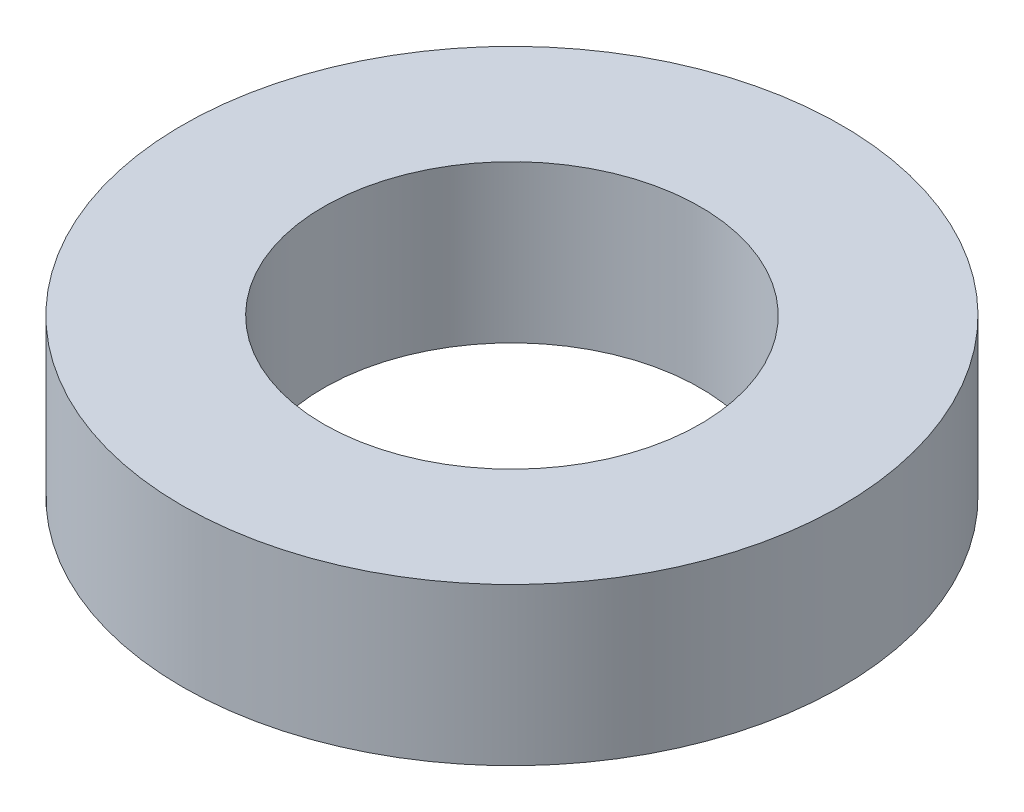
ISO-10303-21;
HEADER;
FILE_DESCRIPTION(('STEP AP214'),'2;1');
FILE_NAME('part.step','',(''),(''),'','','');
FILE_SCHEMA(('AUTOMOTIVE_DESIGN { 1 0 10303 214 1 1 1 1 }'));
ENDSEC;
DATA;
#1=APPLICATION_CONTEXT('core data for automotive mechanical design processes');
#2=APPLICATION_PROTOCOL_DEFINITION('international standard','automotive_design',2000,#1);
#3=PRODUCT_CONTEXT('',#1,'mechanical');
#4=PRODUCT('Part','Part','',(#3));
#5=PRODUCT_RELATED_PRODUCT_CATEGORY('part','',(#4));
#6=PRODUCT_DEFINITION_FORMATION('','',#4);
#7=PRODUCT_DEFINITION_CONTEXT('part definition',#1,'design');
#8=PRODUCT_DEFINITION('design','',#6,#7);
#9=PRODUCT_DEFINITION_SHAPE('','',#8);
#10=(LENGTH_UNIT() NAMED_UNIT(*) SI_UNIT(.MILLI.,.METRE.));
#11=(NAMED_UNIT(*) PLANE_ANGLE_UNIT() SI_UNIT($,.RADIAN.));
#12=(NAMED_UNIT(*) SI_UNIT($,.STERADIAN.) SOLID_ANGLE_UNIT());
#13=UNCERTAINTY_MEASURE_WITH_UNIT(LENGTH_MEASURE(1.E-05),#10,'distance_accuracy_value','');
#14=(GEOMETRIC_REPRESENTATION_CONTEXT(3) GLOBAL_UNCERTAINTY_ASSIGNED_CONTEXT((#13)) GLOBAL_UNIT_ASSIGNED_CONTEXT((#10,
#11,#12)) REPRESENTATION_CONTEXT('',''));
#15=CARTESIAN_POINT('',(0.,0.,0.));
#16=DIRECTION('',(0.,0.,1.));
#17=DIRECTION('',(1.,0.,0.));
#18=AXIS2_PLACEMENT_3D('',#15,#16,#17);
#19=CARTESIAN_POINT('',(0.,5.,0.));
#20=DIRECTION('',(0.,-1.,0.));
#21=DIRECTION('',(0.,0.,-1.));
#22=AXIS2_PLACEMENT_3D('',#19,#20,#21);
#23=CYLINDRICAL_SURFACE('',#22,10.5);
#24=CARTESIAN_POINT('',(0.,5.,0.));
#25=DIRECTION('',(0.,1.,0.));
#26=DIRECTION('',(0.,0.,1.));
#27=AXIS2_PLACEMENT_3D('',#24,#25,#26);
#28=CIRCLE('',#27,10.5);
#29=CARTESIAN_POINT('',(0.,5.,10.5));
#30=VERTEX_POINT('',#29);
#31=EDGE_CURVE('E10',#30,#30,#28,.T.);
#32=ORIENTED_EDGE('',*,*,#31,.F.);
#33=EDGE_LOOP('',(#32));
#34=FACE_BOUND('',#33,.T.);
#35=CARTESIAN_POINT('',(0.,0.,0.));
#36=DIRECTION('',(0.,1.,0.));
#37=DIRECTION('',(0.,0.,1.));
#38=AXIS2_PLACEMENT_3D('',#35,#36,#37);
#39=CIRCLE('',#38,10.5);
#40=CARTESIAN_POINT('',(0.,0.,10.5));
#41=VERTEX_POINT('',#40);
#42=EDGE_CURVE('E51',#41,#41,#39,.T.);
#43=ORIENTED_EDGE('',*,*,#42,.T.);
#44=EDGE_LOOP('',(#43));
#45=FACE_BOUND('',#44,.T.);
#46=ADVANCED_FACE('F43',(#34,#45),#23,.T.);
#47=CARTESIAN_POINT('',(0.,5.,0.));
#48=DIRECTION('',(0.,1.,0.));
#49=DIRECTION('',(0.,0.,1.));
#50=AXIS2_PLACEMENT_3D('',#47,#48,#49);
#51=PLANE('',#50);
#52=CARTESIAN_POINT('',(0.,5.,0.));
#53=DIRECTION('',(0.,1.,0.));
#54=DIRECTION('',(0.,0.,1.));
#55=AXIS2_PLACEMENT_3D('',#52,#53,#54);
#56=CIRCLE('',#55,6.);
#57=CARTESIAN_POINT('',(0.,5.,6.));
#58=VERTEX_POINT('',#57);
#59=EDGE_CURVE('E58',#58,#58,#56,.T.);
#60=ORIENTED_EDGE('',*,*,#59,.F.);
#61=EDGE_LOOP('',(#60));
#62=FACE_BOUND('',#61,.T.);
#63=ORIENTED_EDGE('',*,*,#31,.T.);
#64=EDGE_LOOP('',(#63));
#65=FACE_BOUND('',#64,.T.);
#66=ADVANCED_FACE('F76',(#62,#65),#51,.T.);
#67=CARTESIAN_POINT('',(0.,0.,0.));
#68=DIRECTION('',(0.,1.,0.));
#69=DIRECTION('',(0.,0.,1.));
#70=AXIS2_PLACEMENT_3D('',#67,#68,#69);
#71=PLANE('',#70);
#72=CARTESIAN_POINT('',(0.,0.,0.));
#73=DIRECTION('',(0.,1.,0.));
#74=DIRECTION('',(0.,0.,1.));
#75=AXIS2_PLACEMENT_3D('',#72,#73,#74);
#76=CIRCLE('',#75,6.);
#77=CARTESIAN_POINT('',(0.,0.,6.));
#78=VERTEX_POINT('',#77);
#79=EDGE_CURVE('E46',#78,#78,#76,.T.);
#80=ORIENTED_EDGE('',*,*,#79,.T.);
#81=EDGE_LOOP('',(#80));
#82=FACE_BOUND('',#81,.T.);
#83=ORIENTED_EDGE('',*,*,#42,.F.);
#84=EDGE_LOOP('',(#83));
#85=FACE_BOUND('',#84,.T.);
#86=ADVANCED_FACE('F67',(#82,#85),#71,.F.);
#87=CARTESIAN_POINT('',(0.,-3.,0.));
#88=DIRECTION('',(0.,1.,0.));
#89=DIRECTION('',(0.,0.,1.));
#90=AXIS2_PLACEMENT_3D('',#87,#88,#89);
#91=CYLINDRICAL_SURFACE('',#90,6.);
#92=ORIENTED_EDGE('',*,*,#59,.T.);
#93=EDGE_LOOP('',(#92));
#94=FACE_BOUND('',#93,.T.);
#95=ORIENTED_EDGE('',*,*,#79,.F.);
#96=EDGE_LOOP('',(#95));
#97=FACE_BOUND('',#96,.T.);
#98=ADVANCED_FACE('F70',(#94,#97),#91,.F.);
#99=CLOSED_SHELL('',(#46,#66,#86,#98));
#100=MANIFOLD_SOLID_BREP('B2',#99);
#101=ADVANCED_BREP_SHAPE_REPRESENTATION('',(#18,#100),#14);
#102=SHAPE_DEFINITION_REPRESENTATION(#9,#101);
ENDSEC;
END-ISO-10303-21;
